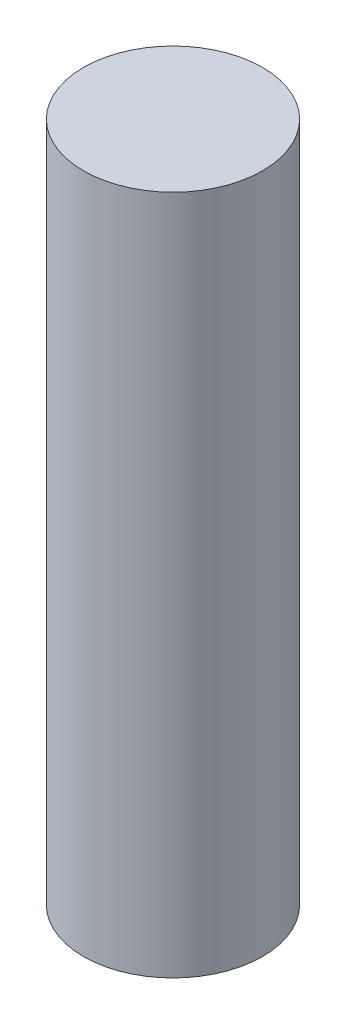
ISO-10303-21;
HEADER;
FILE_DESCRIPTION(('STEP AP214'),'2;1');
FILE_NAME('part.step','',(''),(''),'','','');
FILE_SCHEMA(('AUTOMOTIVE_DESIGN { 1 0 10303 214 1 1 1 1 }'));
ENDSEC;
DATA;
#1=APPLICATION_CONTEXT('core data for automotive mechanical design processes');
#2=APPLICATION_PROTOCOL_DEFINITION('international standard','automotive_design',2000,#1);
#3=PRODUCT_CONTEXT('',#1,'mechanical');
#4=PRODUCT('Part','Part','',(#3));
#5=PRODUCT_RELATED_PRODUCT_CATEGORY('part','',(#4));
#6=PRODUCT_DEFINITION_FORMATION('','',#4);
#7=PRODUCT_DEFINITION_CONTEXT('part definition',#1,'design');
#8=PRODUCT_DEFINITION('design','',#6,#7);
#9=PRODUCT_DEFINITION_SHAPE('','',#8);
#10=(LENGTH_UNIT() NAMED_UNIT(*) SI_UNIT(.MILLI.,.METRE.));
#11=(NAMED_UNIT(*) PLANE_ANGLE_UNIT() SI_UNIT($,.RADIAN.));
#12=(NAMED_UNIT(*) SI_UNIT($,.STERADIAN.) SOLID_ANGLE_UNIT());
#13=UNCERTAINTY_MEASURE_WITH_UNIT(LENGTH_MEASURE(1.E-05),#10,'distance_accuracy_value','');
#14=(GEOMETRIC_REPRESENTATION_CONTEXT(3) GLOBAL_UNCERTAINTY_ASSIGNED_CONTEXT((#13)) GLOBAL_UNIT_ASSIGNED_CONTEXT((#10,
#11,#12)) REPRESENTATION_CONTEXT('',''));
#15=CARTESIAN_POINT('',(0.,0.,0.));
#16=DIRECTION('',(0.,0.,1.));
#17=DIRECTION('',(1.,0.,0.));
#18=AXIS2_PLACEMENT_3D('',#15,#16,#17);
#19=CARTESIAN_POINT('',(0.,11.4,0.));
#20=DIRECTION('',(0.,-1.,0.));
#21=DIRECTION('',(0.,0.,-1.));
#22=AXIS2_PLACEMENT_3D('',#19,#20,#21);
#23=CYLINDRICAL_SURFACE('',#22,1.5);
#24=CARTESIAN_POINT('',(0.,11.4,0.));
#25=DIRECTION('',(0.,1.,0.));
#26=DIRECTION('',(0.,0.,1.));
#27=AXIS2_PLACEMENT_3D('',#24,#25,#26);
#28=CIRCLE('',#27,1.5);
#29=CARTESIAN_POINT('',(0.,11.4,1.5));
#30=VERTEX_POINT('',#29);
#31=EDGE_CURVE('E10',#30,#30,#28,.T.);
#32=ORIENTED_EDGE('',*,*,#31,.F.);
#33=EDGE_LOOP('',(#32));
#34=FACE_BOUND('',#33,.T.);
#35=CARTESIAN_POINT('',(0.,0.,0.));
#36=DIRECTION('',(0.,1.,0.));
#37=DIRECTION('',(0.,0.,1.));
#38=AXIS2_PLACEMENT_3D('',#35,#36,#37);
#39=CIRCLE('',#38,1.5);
#40=CARTESIAN_POINT('',(0.,0.,1.5));
#41=VERTEX_POINT('',#40);
#42=EDGE_CURVE('E38',#41,#41,#39,.T.);
#43=ORIENTED_EDGE('',*,*,#42,.T.);
#44=EDGE_LOOP('',(#43));
#45=FACE_BOUND('',#44,.T.);
#46=ADVANCED_FACE('F35',(#34,#45),#23,.T.);
#47=CARTESIAN_POINT('',(0.,11.4,0.));
#48=DIRECTION('',(0.,1.,0.));
#49=DIRECTION('',(0.,0.,1.));
#50=AXIS2_PLACEMENT_3D('',#47,#48,#49);
#51=PLANE('',#50);
#52=ORIENTED_EDGE('',*,*,#31,.T.);
#53=EDGE_LOOP('',(#52));
#54=FACE_BOUND('',#53,.T.);
#55=ADVANCED_FACE('F50',(#54),#51,.T.);
#56=CARTESIAN_POINT('',(0.,0.,0.));
#57=DIRECTION('',(0.,1.,0.));
#58=DIRECTION('',(0.,0.,1.));
#59=AXIS2_PLACEMENT_3D('',#56,#57,#58);
#60=PLANE('',#59);
#61=ORIENTED_EDGE('',*,*,#42,.F.);
#62=EDGE_LOOP('',(#61));
#63=FACE_BOUND('',#62,.T.);
#64=ADVANCED_FACE('F48',(#63),#60,.F.);
#65=CLOSED_SHELL('',(#46,#55,#64));
#66=MANIFOLD_SOLID_BREP('B2',#65);
#67=ADVANCED_BREP_SHAPE_REPRESENTATION('',(#18,#66),#14);
#68=SHAPE_DEFINITION_REPRESENTATION(#9,#67);
ENDSEC;
END-ISO-10303-21;
